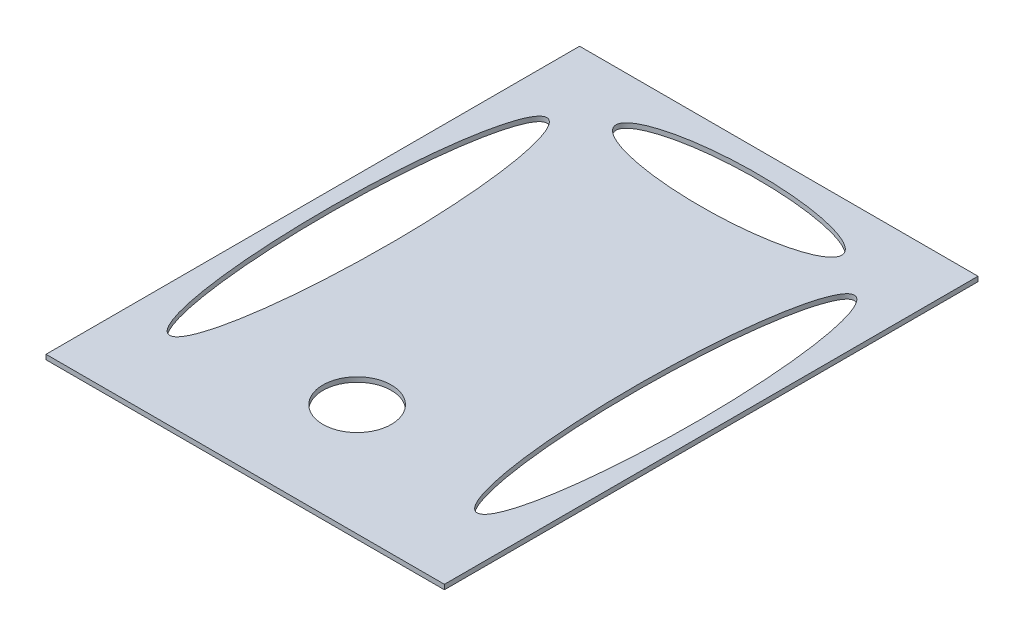
ISO-10303-21;
HEADER;
FILE_DESCRIPTION(('STEP AP214'),'2;1');
FILE_NAME('part.step','',(''),(''),'','','');
FILE_SCHEMA(('AUTOMOTIVE_DESIGN { 1 0 10303 214 1 1 1 1 }'));
ENDSEC;
DATA;
#1=APPLICATION_CONTEXT('core data for automotive mechanical design processes');
#2=APPLICATION_PROTOCOL_DEFINITION('international standard','automotive_design',2000,#1);
#3=PRODUCT_CONTEXT('',#1,'mechanical');
#4=PRODUCT('Part','Part','',(#3));
#5=PRODUCT_RELATED_PRODUCT_CATEGORY('part','',(#4));
#6=PRODUCT_DEFINITION_FORMATION('','',#4);
#7=PRODUCT_DEFINITION_CONTEXT('part definition',#1,'design');
#8=PRODUCT_DEFINITION('design','',#6,#7);
#9=PRODUCT_DEFINITION_SHAPE('','',#8);
#10=(LENGTH_UNIT() NAMED_UNIT(*) SI_UNIT(.MILLI.,.METRE.));
#11=(NAMED_UNIT(*) PLANE_ANGLE_UNIT() SI_UNIT($,.RADIAN.));
#12=(NAMED_UNIT(*) SI_UNIT($,.STERADIAN.) SOLID_ANGLE_UNIT());
#13=UNCERTAINTY_MEASURE_WITH_UNIT(LENGTH_MEASURE(1.E-05),#10,'distance_accuracy_value','');
#14=(GEOMETRIC_REPRESENTATION_CONTEXT(3) GLOBAL_UNCERTAINTY_ASSIGNED_CONTEXT((#13)) GLOBAL_UNIT_ASSIGNED_CONTEXT((#10,
#11,#12)) REPRESENTATION_CONTEXT('',''));
#15=CARTESIAN_POINT('',(0.,0.,0.));
#16=DIRECTION('',(0.,0.,1.));
#17=DIRECTION('',(1.,0.,0.));
#18=AXIS2_PLACEMENT_3D('',#15,#16,#17);
#19=CARTESIAN_POINT('',(0.,5.,0.));
#20=DIRECTION('',(0.,1.,0.));
#21=DIRECTION('',(0.,0.,1.));
#22=AXIS2_PLACEMENT_3D('',#19,#20,#21);
#23=PLANE('',#22);
#24=CARTESIAN_POINT('',(321.840155866302,5.,-225.374515725833));
#25=DIRECTION('',(0.,-1.,0.));
#26=DIRECTION('',(0.,0.,-1.));
#27=AXIS2_PLACEMENT_3D('',#24,#25,#26);
#28=ELLIPSE('',#27,197.413092706227,32.2357517422347);
#29=CARTESIAN_POINT('',(321.840155866302,5.,-422.78760843206));
#30=VERTEX_POINT('',#29);
#31=EDGE_CURVE('E125',#30,#30,#28,.T.);
#32=ORIENTED_EDGE('',*,*,#31,.T.);
#33=EDGE_LOOP('',(#32));
#34=FACE_BOUND('',#33,.T.);
#35=DIRECTION('',(0.,0.,1.));
#36=VECTOR('',#35,1.);
#37=CARTESIAN_POINT('',(-47.579922066849,5.,-504.624515725833));
#38=LINE('',#37,#36);
#39=CARTESIAN_POINT('',(-47.579922066849,5.,-504.624515725833));
#40=VERTEX_POINT('',#39);
#41=CARTESIAN_POINT('',(-47.579922066849,5.,53.8754842741675));
#42=VERTEX_POINT('',#41);
#43=EDGE_CURVE('E87',#40,#42,#38,.T.);
#44=ORIENTED_EDGE('',*,*,#43,.T.);
#45=DIRECTION('',(1.,0.,0.));
#46=VECTOR('',#45,1.);
#47=CARTESIAN_POINT('',(-47.579922066849,5.,53.8754842741675));
#48=LINE('',#47,#46);
#49=CARTESIAN_POINT('',(369.420077933151,5.,53.8754842741675));
#50=VERTEX_POINT('',#49);
#51=EDGE_CURVE('E82',#42,#50,#48,.T.);
#52=ORIENTED_EDGE('',*,*,#51,.T.);
#53=DIRECTION('',(0.,0.,-1.));
#54=VECTOR('',#53,1.);
#55=CARTESIAN_POINT('',(369.420077933151,5.,-504.624515725833));
#56=LINE('',#55,#54);
#57=CARTESIAN_POINT('',(369.420077933151,5.,-504.624515725833));
#58=VERTEX_POINT('',#57);
#59=EDGE_CURVE('E85',#50,#58,#56,.T.);
#60=ORIENTED_EDGE('',*,*,#59,.T.);
#61=DIRECTION('',(-1.,0.,0.));
#62=VECTOR('',#61,1.);
#63=CARTESIAN_POINT('',(-47.579922066849,5.,-504.624515725833));
#64=LINE('',#63,#62);
#65=EDGE_CURVE('E52',#58,#40,#64,.T.);
#66=ORIENTED_EDGE('',*,*,#65,.T.);
#67=EDGE_LOOP('',(#44,#52,#60,#66));
#68=FACE_BOUND('',#67,.T.);
#69=CARTESIAN_POINT('',(160.920077933151,5.,-63.2505157258325));
#70=DIRECTION('',(0.,1.,0.));
#71=DIRECTION('',(0.,0.,1.));
#72=AXIS2_PLACEMENT_3D('',#69,#70,#71);
#73=CIRCLE('',#72,35.8);
#74=CARTESIAN_POINT('',(160.920077933151,5.,-27.4505157258325));
#75=VERTEX_POINT('',#74);
#76=EDGE_CURVE('E117',#75,#75,#73,.T.);
#77=ORIENTED_EDGE('',*,*,#76,.F.);
#78=EDGE_LOOP('',(#77));
#79=FACE_BOUND('',#78,.T.);
#80=CARTESIAN_POINT('',(160.920077933151,5.,-452.428200679108));
#81=DIRECTION('',(0.,1.,0.));
#82=DIRECTION('',(-1.,0.,0.));
#83=AXIS2_PLACEMENT_3D('',#80,#81,#82);
#84=ELLIPSE('',#83,118.175604420225,29.6405922470484);
#85=CARTESIAN_POINT('',(42.7444735129257,5.,-452.428200679108));
#86=VERTEX_POINT('',#85);
#87=EDGE_CURVE('E118',#86,#86,#84,.T.);
#88=ORIENTED_EDGE('',*,*,#87,.F.);
#89=EDGE_LOOP('',(#88));
#90=FACE_BOUND('',#89,.T.);
#91=CARTESIAN_POINT('',(0.,5.,-225.374515725833));
#92=DIRECTION('',(0.,1.,0.));
#93=DIRECTION('',(0.,0.,-1.));
#94=AXIS2_PLACEMENT_3D('',#91,#92,#93);
#95=ELLIPSE('',#94,197.413092706227,32.2357517422347);
#96=CARTESIAN_POINT('',(0.,5.,-422.78760843206));
#97=VERTEX_POINT('',#96);
#98=EDGE_CURVE('E219',#97,#97,#95,.T.);
#99=ORIENTED_EDGE('',*,*,#98,.F.);
#100=EDGE_LOOP('',(#99));
#101=FACE_BOUND('',#100,.T.);
#102=ADVANCED_FACE('F35',(#34,#68,#79,#90,#101),#23,.T.);
#103=CARTESIAN_POINT('',(0.,0.,0.));
#104=DIRECTION('',(0.,1.,0.));
#105=DIRECTION('',(0.,0.,1.));
#106=AXIS2_PLACEMENT_3D('',#103,#104,#105);
#107=PLANE('',#106);
#108=CARTESIAN_POINT('',(160.920077933151,0.,-452.428200679108));
#109=DIRECTION('',(0.,1.,0.));
#110=DIRECTION('',(-1.,0.,0.));
#111=AXIS2_PLACEMENT_3D('',#108,#109,#110);
#112=ELLIPSE('',#111,118.175604420225,29.6405922470484);
#113=CARTESIAN_POINT('',(42.7444735129257,0.,-452.428200679108));
#114=VERTEX_POINT('',#113);
#115=EDGE_CURVE('E223',#114,#114,#112,.T.);
#116=ORIENTED_EDGE('',*,*,#115,.T.);
#117=EDGE_LOOP('',(#116));
#118=FACE_BOUND('',#117,.T.);
#119=DIRECTION('',(0.,0.,1.));
#120=VECTOR('',#119,1.);
#121=CARTESIAN_POINT('',(-47.579922066849,0.,-504.624515725833));
#122=LINE('',#121,#120);
#123=CARTESIAN_POINT('',(-47.579922066849,0.,-504.624515725833));
#124=VERTEX_POINT('',#123);
#125=CARTESIAN_POINT('',(-47.579922066849,0.,53.8754842741675));
#126=VERTEX_POINT('',#125);
#127=EDGE_CURVE('E99',#124,#126,#122,.T.);
#128=ORIENTED_EDGE('',*,*,#127,.F.);
#129=DIRECTION('',(-1.,0.,0.));
#130=VECTOR('',#129,1.);
#131=CARTESIAN_POINT('',(-47.579922066849,0.,-504.624515725833));
#132=LINE('',#131,#130);
#133=CARTESIAN_POINT('',(369.420077933151,0.,-504.624515725833));
#134=VERTEX_POINT('',#133);
#135=EDGE_CURVE('E75',#134,#124,#132,.T.);
#136=ORIENTED_EDGE('',*,*,#135,.F.);
#137=DIRECTION('',(0.,0.,-1.));
#138=VECTOR('',#137,1.);
#139=CARTESIAN_POINT('',(369.420077933151,0.,-504.624515725833));
#140=LINE('',#139,#138);
#141=CARTESIAN_POINT('',(369.420077933151,0.,53.8754842741675));
#142=VERTEX_POINT('',#141);
#143=EDGE_CURVE('E69',#142,#134,#140,.T.);
#144=ORIENTED_EDGE('',*,*,#143,.F.);
#145=DIRECTION('',(1.,0.,0.));
#146=VECTOR('',#145,1.);
#147=CARTESIAN_POINT('',(-47.579922066849,0.,53.8754842741675));
#148=LINE('',#147,#146);
#149=EDGE_CURVE('E91',#126,#142,#148,.T.);
#150=ORIENTED_EDGE('',*,*,#149,.F.);
#151=EDGE_LOOP('',(#128,#136,#144,#150));
#152=FACE_BOUND('',#151,.T.);
#153=CARTESIAN_POINT('',(321.840155866302,0.,-225.374515725833));
#154=DIRECTION('',(0.,-1.,0.));
#155=DIRECTION('',(0.,0.,-1.));
#156=AXIS2_PLACEMENT_3D('',#153,#154,#155);
#157=ELLIPSE('',#156,197.413092706227,32.2357517422347);
#158=CARTESIAN_POINT('',(321.840155866302,0.,-422.78760843206));
#159=VERTEX_POINT('',#158);
#160=EDGE_CURVE('E121',#159,#159,#157,.T.);
#161=ORIENTED_EDGE('',*,*,#160,.F.);
#162=EDGE_LOOP('',(#161));
#163=FACE_BOUND('',#162,.T.);
#164=CARTESIAN_POINT('',(160.920077933151,0.,-63.2505157258325));
#165=DIRECTION('',(0.,1.,0.));
#166=DIRECTION('',(0.,0.,1.));
#167=AXIS2_PLACEMENT_3D('',#164,#165,#166);
#168=CIRCLE('',#167,35.8);
#169=CARTESIAN_POINT('',(160.920077933151,0.,-27.4505157258325));
#170=VERTEX_POINT('',#169);
#171=EDGE_CURVE('E114',#170,#170,#168,.T.);
#172=ORIENTED_EDGE('',*,*,#171,.T.);
#173=EDGE_LOOP('',(#172));
#174=FACE_BOUND('',#173,.T.);
#175=CARTESIAN_POINT('',(0.,0.,-225.374515725833));
#176=DIRECTION('',(0.,1.,0.));
#177=DIRECTION('',(0.,0.,-1.));
#178=AXIS2_PLACEMENT_3D('',#175,#176,#177);
#179=ELLIPSE('',#178,197.413092706227,32.2357517422347);
#180=CARTESIAN_POINT('',(0.,0.,-422.78760843206));
#181=VERTEX_POINT('',#180);
#182=EDGE_CURVE('E102',#181,#181,#179,.T.);
#183=ORIENTED_EDGE('',*,*,#182,.T.);
#184=EDGE_LOOP('',(#183));
#185=FACE_BOUND('',#184,.T.);
#186=ADVANCED_FACE('F110',(#118,#152,#163,#174,#185),#107,.F.);
#187=CARTESIAN_POINT('',(-47.579922066849,5.,-504.624515725833));
#188=DIRECTION('',(1.,0.,0.));
#189=DIRECTION('',(0.,0.,-1.));
#190=AXIS2_PLACEMENT_3D('',#187,#188,#189);
#191=PLANE('',#190);
#192=ORIENTED_EDGE('',*,*,#127,.T.);
#193=DIRECTION('',(0.,-1.,0.));
#194=VECTOR('',#193,1.);
#195=CARTESIAN_POINT('',(-47.579922066849,5.,53.8754842741675));
#196=LINE('',#195,#194);
#197=EDGE_CURVE('E11',#42,#126,#196,.T.);
#198=ORIENTED_EDGE('',*,*,#197,.F.);
#199=ORIENTED_EDGE('',*,*,#43,.F.);
#200=DIRECTION('',(0.,-1.,0.));
#201=VECTOR('',#200,1.);
#202=CARTESIAN_POINT('',(-47.579922066849,5.,-504.624515725833));
#203=LINE('',#202,#201);
#204=EDGE_CURVE('E95',#40,#124,#203,.T.);
#205=ORIENTED_EDGE('',*,*,#204,.T.);
#206=EDGE_LOOP('',(#192,#198,#199,#205));
#207=FACE_BOUND('',#206,.T.);
#208=ADVANCED_FACE('F37',(#207),#191,.F.);
#209=CARTESIAN_POINT('',(-47.579922066849,5.,53.8754842741675));
#210=DIRECTION('',(0.,0.,-1.));
#211=DIRECTION('',(-1.,0.,0.));
#212=AXIS2_PLACEMENT_3D('',#209,#210,#211);
#213=PLANE('',#212);
#214=ORIENTED_EDGE('',*,*,#149,.T.);
#215=DIRECTION('',(0.,-1.,0.));
#216=VECTOR('',#215,1.);
#217=CARTESIAN_POINT('',(369.420077933151,5.,53.8754842741675));
#218=LINE('',#217,#216);
#219=EDGE_CURVE('E44',#50,#142,#218,.T.);
#220=ORIENTED_EDGE('',*,*,#219,.F.);
#221=ORIENTED_EDGE('',*,*,#51,.F.);
#222=ORIENTED_EDGE('',*,*,#197,.T.);
#223=EDGE_LOOP('',(#214,#220,#221,#222));
#224=FACE_BOUND('',#223,.T.);
#225=ADVANCED_FACE('F90',(#224),#213,.F.);
#226=CARTESIAN_POINT('',(369.420077933151,5.,-504.624515725833));
#227=DIRECTION('',(-1.,0.,0.));
#228=DIRECTION('',(0.,0.,1.));
#229=AXIS2_PLACEMENT_3D('',#226,#227,#228);
#230=PLANE('',#229);
#231=ORIENTED_EDGE('',*,*,#143,.T.);
#232=DIRECTION('',(0.,-1.,0.));
#233=VECTOR('',#232,1.);
#234=CARTESIAN_POINT('',(369.420077933151,5.,-504.624515725833));
#235=LINE('',#234,#233);
#236=EDGE_CURVE('E92',#58,#134,#235,.T.);
#237=ORIENTED_EDGE('',*,*,#236,.F.);
#238=ORIENTED_EDGE('',*,*,#59,.F.);
#239=ORIENTED_EDGE('',*,*,#219,.T.);
#240=EDGE_LOOP('',(#231,#237,#238,#239));
#241=FACE_BOUND('',#240,.T.);
#242=ADVANCED_FACE('F93',(#241),#230,.F.);
#243=CARTESIAN_POINT('',(-47.579922066849,5.,-504.624515725833));
#244=DIRECTION('',(0.,0.,1.));
#245=DIRECTION('',(1.,0.,0.));
#246=AXIS2_PLACEMENT_3D('',#243,#244,#245);
#247=PLANE('',#246);
#248=ORIENTED_EDGE('',*,*,#135,.T.);
#249=ORIENTED_EDGE('',*,*,#204,.F.);
#250=ORIENTED_EDGE('',*,*,#65,.F.);
#251=ORIENTED_EDGE('',*,*,#236,.T.);
#252=EDGE_LOOP('',(#248,#249,#250,#251));
#253=FACE_BOUND('',#252,.T.);
#254=ADVANCED_FACE('F107',(#253),#247,.F.);
#255=DIRECTION('',(0.,1.,0.));
#256=VECTOR('',#255,1.);
#257=SURFACE_OF_LINEAR_EXTRUSION('',#157,#256);
#258=ORIENTED_EDGE('',*,*,#160,.T.);
#259=EDGE_LOOP('',(#258));
#260=FACE_BOUND('',#259,.T.);
#261=ORIENTED_EDGE('',*,*,#31,.F.);
#262=EDGE_LOOP('',(#261));
#263=FACE_BOUND('',#262,.T.);
#264=ADVANCED_FACE('F128',(#260,#263),#257,.T.);
#265=CARTESIAN_POINT('',(160.920077933151,0.,-63.2505157258325));
#266=DIRECTION('',(0.,1.,0.));
#267=DIRECTION('',(0.,0.,1.));
#268=AXIS2_PLACEMENT_3D('',#265,#266,#267);
#269=CYLINDRICAL_SURFACE('',#268,35.8);
#270=ORIENTED_EDGE('',*,*,#171,.F.);
#271=EDGE_LOOP('',(#270));
#272=FACE_BOUND('',#271,.T.);
#273=ORIENTED_EDGE('',*,*,#76,.T.);
#274=EDGE_LOOP('',(#273));
#275=FACE_BOUND('',#274,.T.);
#276=ADVANCED_FACE('F132',(#272,#275),#269,.F.);
#277=DIRECTION('',(0.,1.,0.));
#278=VECTOR('',#277,1.);
#279=SURFACE_OF_LINEAR_EXTRUSION('',#112,#278);
#280=ORIENTED_EDGE('',*,*,#115,.F.);
#281=EDGE_LOOP('',(#280));
#282=FACE_BOUND('',#281,.T.);
#283=ORIENTED_EDGE('',*,*,#87,.T.);
#284=EDGE_LOOP('',(#283));
#285=FACE_BOUND('',#284,.T.);
#286=ADVANCED_FACE('F134',(#282,#285),#279,.F.);
#287=DIRECTION('',(0.,1.,0.));
#288=VECTOR('',#287,1.);
#289=SURFACE_OF_LINEAR_EXTRUSION('',#179,#288);
#290=ORIENTED_EDGE('',*,*,#182,.F.);
#291=EDGE_LOOP('',(#290));
#292=FACE_BOUND('',#291,.T.);
#293=ORIENTED_EDGE('',*,*,#98,.T.);
#294=EDGE_LOOP('',(#293));
#295=FACE_BOUND('',#294,.T.);
#296=ADVANCED_FACE('F196',(#292,#295),#289,.F.);
#297=CLOSED_SHELL('',(#102,#186,#208,#225,#242,#254,#264,#276,#286,#296));
#298=MANIFOLD_SOLID_BREP('B2',#297);
#299=ADVANCED_BREP_SHAPE_REPRESENTATION('',(#18,#298),#14);
#300=SHAPE_DEFINITION_REPRESENTATION(#9,#299);
ENDSEC;
END-ISO-10303-21;
